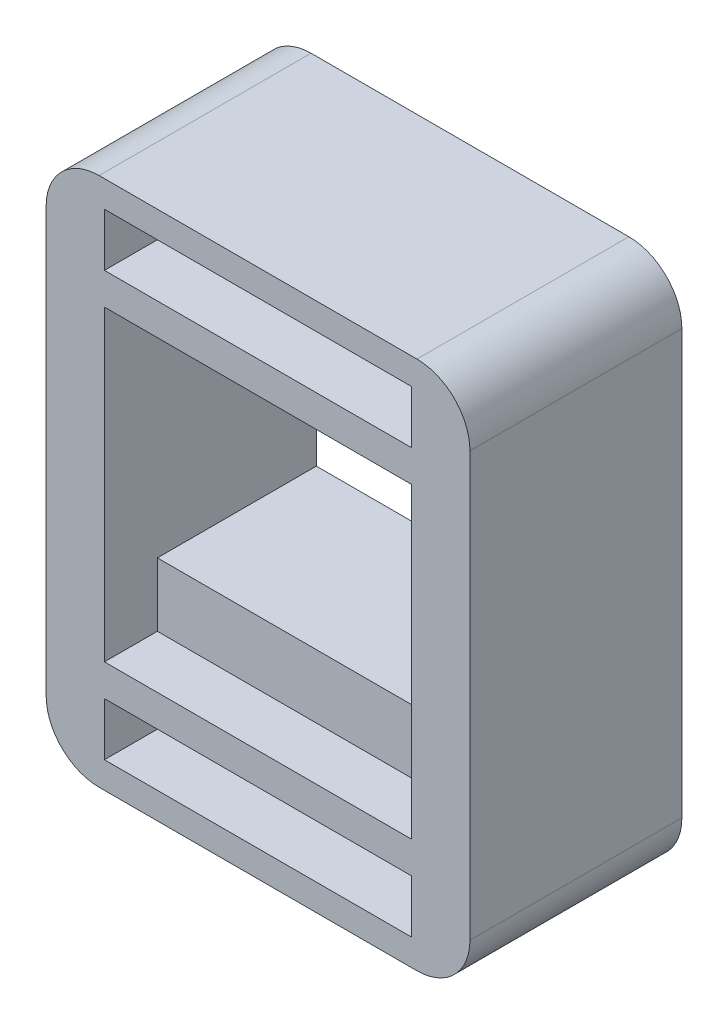
ISO-10303-21;
HEADER;
FILE_DESCRIPTION(('STEP AP214'),'2;1');
FILE_NAME('part.step','',(''),(''),'','','');
FILE_SCHEMA(('AUTOMOTIVE_DESIGN { 1 0 10303 214 1 1 1 1 }'));
ENDSEC;
DATA;
#1=APPLICATION_CONTEXT('core data for automotive mechanical design processes');
#2=APPLICATION_PROTOCOL_DEFINITION('international standard','automotive_design',2000,#1);
#3=PRODUCT_CONTEXT('',#1,'mechanical');
#4=PRODUCT('Part','Part','',(#3));
#5=PRODUCT_RELATED_PRODUCT_CATEGORY('part','',(#4));
#6=PRODUCT_DEFINITION_FORMATION('','',#4);
#7=PRODUCT_DEFINITION_CONTEXT('part definition',#1,'design');
#8=PRODUCT_DEFINITION('design','',#6,#7);
#9=PRODUCT_DEFINITION_SHAPE('','',#8);
#10=(LENGTH_UNIT() NAMED_UNIT(*) SI_UNIT(.MILLI.,.METRE.));
#11=(NAMED_UNIT(*) PLANE_ANGLE_UNIT() SI_UNIT($,.RADIAN.));
#12=(NAMED_UNIT(*) SI_UNIT($,.STERADIAN.) SOLID_ANGLE_UNIT());
#13=UNCERTAINTY_MEASURE_WITH_UNIT(LENGTH_MEASURE(1.E-05),#10,'distance_accuracy_value','');
#14=(GEOMETRIC_REPRESENTATION_CONTEXT(3) GLOBAL_UNCERTAINTY_ASSIGNED_CONTEXT((#13)) GLOBAL_UNIT_ASSIGNED_CONTEXT((#10,
#11,#12)) REPRESENTATION_CONTEXT('',''));
#15=CARTESIAN_POINT('',(0.,0.,0.));
#16=DIRECTION('',(0.,0.,1.));
#17=DIRECTION('',(1.,0.,0.));
#18=AXIS2_PLACEMENT_3D('',#15,#16,#17);
#19=CARTESIAN_POINT('',(0.,24.,20.));
#20=DIRECTION('',(0.,1.,0.));
#21=DIRECTION('',(0.,0.,1.));
#22=AXIS2_PLACEMENT_3D('',#19,#20,#21);
#23=PLANE('',#22);
#24=DIRECTION('',(1.,0.,0.));
#25=VECTOR('',#24,1.);
#26=CARTESIAN_POINT('',(8.,24.,15.));
#27=LINE('',#26,#25);
#28=CARTESIAN_POINT('',(0.,24.,15.));
#29=VERTEX_POINT('',#28);
#30=CARTESIAN_POINT('',(8.,24.,15.));
#31=VERTEX_POINT('',#30);
#32=EDGE_CURVE('E321',#29,#31,#27,.T.);
#33=ORIENTED_EDGE('',*,*,#32,.F.);
#34=DIRECTION('',(0.,0.,-1.));
#35=VECTOR('',#34,1.);
#36=CARTESIAN_POINT('',(0.,24.,20.));
#37=LINE('',#36,#35);
#38=CARTESIAN_POINT('',(0.,24.,0.));
#39=VERTEX_POINT('',#38);
#40=EDGE_CURVE('E469',#29,#39,#37,.T.);
#41=ORIENTED_EDGE('',*,*,#40,.T.);
#42=DIRECTION('',(1.,0.,0.));
#43=VECTOR('',#42,1.);
#44=CARTESIAN_POINT('',(0.,24.,0.));
#45=LINE('',#44,#43);
#46=CARTESIAN_POINT('',(8.,24.,0.));
#47=VERTEX_POINT('',#46);
#48=EDGE_CURVE('E374',#39,#47,#45,.T.);
#49=ORIENTED_EDGE('',*,*,#48,.T.);
#50=DIRECTION('',(0.,0.,-1.));
#51=VECTOR('',#50,1.);
#52=CARTESIAN_POINT('',(8.,24.,20.));
#53=LINE('',#52,#51);
#54=EDGE_CURVE('E482',#31,#47,#53,.T.);
#55=ORIENTED_EDGE('',*,*,#54,.F.);
#56=EDGE_LOOP('',(#33,#41,#49,#55));
#57=FACE_BOUND('',#56,.T.);
#58=ADVANCED_FACE('F77',(#57),#23,.F.);
#59=CARTESIAN_POINT('',(8.,0.,20.));
#60=DIRECTION('',(1.,0.,0.));
#61=DIRECTION('',(0.,0.,-1.));
#62=AXIS2_PLACEMENT_3D('',#59,#60,#61);
#63=PLANE('',#62);
#64=DIRECTION('',(0.,0.,-1.));
#65=VECTOR('',#64,1.);
#66=CARTESIAN_POINT('',(8.,29.,20.));
#67=LINE('',#66,#65);
#68=CARTESIAN_POINT('',(8.,29.,15.));
#69=VERTEX_POINT('',#68);
#70=CARTESIAN_POINT('',(8.,29.,0.));
#71=VERTEX_POINT('',#70);
#72=EDGE_CURVE('E480',#69,#71,#67,.T.);
#73=ORIENTED_EDGE('',*,*,#72,.F.);
#74=DIRECTION('',(0.,1.,0.));
#75=VECTOR('',#74,1.);
#76=CARTESIAN_POINT('',(8.,24.,15.));
#77=LINE('',#76,#75);
#78=EDGE_CURVE('E302',#31,#69,#77,.T.);
#79=ORIENTED_EDGE('',*,*,#78,.F.);
#80=ORIENTED_EDGE('',*,*,#54,.T.);
#81=DIRECTION('',(0.,-1.,0.));
#82=VECTOR('',#81,1.);
#83=CARTESIAN_POINT('',(8.,0.,0.));
#84=LINE('',#83,#82);
#85=EDGE_CURVE('E377',#71,#47,#84,.T.);
#86=ORIENTED_EDGE('',*,*,#85,.F.);
#87=EDGE_LOOP('',(#73,#79,#80,#86));
#88=FACE_BOUND('',#87,.T.);
#89=ADVANCED_FACE('F508',(#88),#63,.T.);
#90=CARTESIAN_POINT('',(0.,0.,20.));
#91=DIRECTION('',(-1.,0.,0.));
#92=DIRECTION('',(0.,-1.,0.));
#93=AXIS2_PLACEMENT_3D('',#90,#91,#92);
#94=PLANE('',#93);
#95=DIRECTION('',(0.,1.,0.));
#96=VECTOR('',#95,1.);
#97=CARTESIAN_POINT('',(0.,0.,0.));
#98=LINE('',#97,#96);
#99=CARTESIAN_POINT('',(0.,-8.,0.));
#100=VERTEX_POINT('',#99);
#101=CARTESIAN_POINT('',(0.,-3.,0.));
#102=VERTEX_POINT('',#101);
#103=EDGE_CURVE('E430',#100,#102,#98,.T.);
#104=ORIENTED_EDGE('',*,*,#103,.T.);
#105=DIRECTION('',(0.,0.,-1.));
#106=VECTOR('',#105,1.);
#107=CARTESIAN_POINT('',(0.,-3.,20.));
#108=LINE('',#107,#106);
#109=CARTESIAN_POINT('',(0.,-3.,20.));
#110=VERTEX_POINT('',#109);
#111=EDGE_CURVE('E443',#110,#102,#108,.T.);
#112=ORIENTED_EDGE('',*,*,#111,.F.);
#113=DIRECTION('',(0.,1.,0.));
#114=VECTOR('',#113,1.);
#115=CARTESIAN_POINT('',(0.,0.,20.));
#116=LINE('',#115,#114);
#117=CARTESIAN_POINT('',(0.,-8.,20.));
#118=VERTEX_POINT('',#117);
#119=EDGE_CURVE('E363',#118,#110,#116,.T.);
#120=ORIENTED_EDGE('',*,*,#119,.F.);
#121=DIRECTION('',(0.,0.,-1.));
#122=VECTOR('',#121,1.);
#123=CARTESIAN_POINT('',(0.,-8.,20.));
#124=LINE('',#123,#122);
#125=EDGE_CURVE('E446',#118,#100,#124,.T.);
#126=ORIENTED_EDGE('',*,*,#125,.T.);
#127=EDGE_LOOP('',(#104,#112,#120,#126));
#128=FACE_BOUND('',#127,.T.);
#129=ADVANCED_FACE('F531',(#128),#94,.F.);
#130=CARTESIAN_POINT('',(0.,-3.,20.));
#131=DIRECTION('',(0.,1.,0.));
#132=DIRECTION('',(0.,0.,1.));
#133=AXIS2_PLACEMENT_3D('',#130,#131,#132);
#134=PLANE('',#133);
#135=DIRECTION('',(1.,0.,0.));
#136=VECTOR('',#135,1.);
#137=CARTESIAN_POINT('',(0.,-3.,0.));
#138=LINE('',#137,#136);
#139=CARTESIAN_POINT('',(29.,-3.,0.));
#140=VERTEX_POINT('',#139);
#141=EDGE_CURVE('E433',#102,#140,#138,.T.);
#142=ORIENTED_EDGE('',*,*,#141,.T.);
#143=DIRECTION('',(0.,0.,-1.));
#144=VECTOR('',#143,1.);
#145=CARTESIAN_POINT('',(29.,-3.,20.));
#146=LINE('',#145,#144);
#147=CARTESIAN_POINT('',(29.,-3.,20.));
#148=VERTEX_POINT('',#147);
#149=EDGE_CURVE('E440',#148,#140,#146,.T.);
#150=ORIENTED_EDGE('',*,*,#149,.F.);
#151=DIRECTION('',(1.,0.,0.));
#152=VECTOR('',#151,1.);
#153=CARTESIAN_POINT('',(0.,-3.,20.));
#154=LINE('',#153,#152);
#155=EDGE_CURVE('E366',#110,#148,#154,.T.);
#156=ORIENTED_EDGE('',*,*,#155,.F.);
#157=ORIENTED_EDGE('',*,*,#111,.T.);
#158=EDGE_LOOP('',(#142,#150,#156,#157));
#159=FACE_BOUND('',#158,.T.);
#160=ADVANCED_FACE('F590',(#159),#134,.F.);
#161=CARTESIAN_POINT('',(29.,0.,20.));
#162=DIRECTION('',(-1.,0.,0.));
#163=DIRECTION('',(0.,0.,1.));
#164=AXIS2_PLACEMENT_3D('',#161,#162,#163);
#165=PLANE('',#164);
#166=DIRECTION('',(0.,1.,0.));
#167=VECTOR('',#166,1.);
#168=CARTESIAN_POINT('',(29.,0.,0.));
#169=LINE('',#168,#167);
#170=CARTESIAN_POINT('',(29.,-8.,0.));
#171=VERTEX_POINT('',#170);
#172=EDGE_CURVE('E325',#171,#140,#169,.T.);
#173=ORIENTED_EDGE('',*,*,#172,.F.);
#174=DIRECTION('',(0.,0.,-1.));
#175=VECTOR('',#174,1.);
#176=CARTESIAN_POINT('',(29.,-8.,20.));
#177=LINE('',#176,#175);
#178=CARTESIAN_POINT('',(29.,-8.,20.));
#179=VERTEX_POINT('',#178);
#180=EDGE_CURVE('E438',#179,#171,#177,.T.);
#181=ORIENTED_EDGE('',*,*,#180,.F.);
#182=DIRECTION('',(0.,1.,0.));
#183=VECTOR('',#182,1.);
#184=CARTESIAN_POINT('',(29.,0.,20.));
#185=LINE('',#184,#183);
#186=EDGE_CURVE('E368',#179,#148,#185,.T.);
#187=ORIENTED_EDGE('',*,*,#186,.T.);
#188=ORIENTED_EDGE('',*,*,#149,.T.);
#189=EDGE_LOOP('',(#173,#181,#187,#188));
#190=FACE_BOUND('',#189,.T.);
#191=ADVANCED_FACE('F586',(#190),#165,.T.);
#192=CARTESIAN_POINT('',(0.,-8.,20.));
#193=DIRECTION('',(0.,1.,0.));
#194=DIRECTION('',(0.,0.,1.));
#195=AXIS2_PLACEMENT_3D('',#192,#193,#194);
#196=PLANE('',#195);
#197=DIRECTION('',(1.,0.,0.));
#198=VECTOR('',#197,1.);
#199=CARTESIAN_POINT('',(0.,-8.,0.));
#200=LINE('',#199,#198);
#201=EDGE_CURVE('E427',#100,#171,#200,.T.);
#202=ORIENTED_EDGE('',*,*,#201,.F.);
#203=ORIENTED_EDGE('',*,*,#125,.F.);
#204=DIRECTION('',(1.,0.,0.));
#205=VECTOR('',#204,1.);
#206=CARTESIAN_POINT('',(0.,-8.,20.));
#207=LINE('',#206,#205);
#208=EDGE_CURVE('E360',#118,#179,#207,.T.);
#209=ORIENTED_EDGE('',*,*,#208,.T.);
#210=ORIENTED_EDGE('',*,*,#180,.T.);
#211=EDGE_LOOP('',(#202,#203,#209,#210));
#212=FACE_BOUND('',#211,.T.);
#213=ADVANCED_FACE('F560',(#212),#196,.T.);
#214=CARTESIAN_POINT('',(-0.5,-5.5,20.));
#215=DIRECTION('',(0.,0.,-1.));
#216=DIRECTION('',(-1.,0.,0.));
#217=AXIS2_PLACEMENT_3D('',#214,#215,#216);
#218=CYLINDRICAL_SURFACE('',#217,5.);
#219=CARTESIAN_POINT('',(-0.5,-5.5,0.));
#220=DIRECTION('',(0.,0.,1.));
#221=DIRECTION('',(1.,0.,0.));
#222=AXIS2_PLACEMENT_3D('',#219,#220,#221);
#223=CIRCLE('',#222,5.);
#224=CARTESIAN_POINT('',(-0.5,-10.5,0.));
#225=VERTEX_POINT('',#224);
#226=CARTESIAN_POINT('',(-5.5,-5.5,0.));
#227=VERTEX_POINT('',#226);
#228=EDGE_CURVE('E406',#225,#227,#223,.F.);
#229=ORIENTED_EDGE('',*,*,#228,.F.);
#230=DIRECTION('',(0.,0.,-1.));
#231=VECTOR('',#230,1.);
#232=CARTESIAN_POINT('',(-0.5,-10.5,20.));
#233=LINE('',#232,#231);
#234=CARTESIAN_POINT('',(-0.5,-10.5,20.));
#235=VERTEX_POINT('',#234);
#236=EDGE_CURVE('E463',#235,#225,#233,.T.);
#237=ORIENTED_EDGE('',*,*,#236,.F.);
#238=CARTESIAN_POINT('',(-0.5,-5.5,20.));
#239=DIRECTION('',(0.,0.,1.));
#240=DIRECTION('',(1.,0.,0.));
#241=AXIS2_PLACEMENT_3D('',#238,#239,#240);
#242=CIRCLE('',#241,5.);
#243=CARTESIAN_POINT('',(-5.5,-5.5,20.));
#244=VERTEX_POINT('',#243);
#245=EDGE_CURVE('E340',#235,#244,#242,.F.);
#246=ORIENTED_EDGE('',*,*,#245,.T.);
#247=DIRECTION('',(0.,0.,-1.));
#248=VECTOR('',#247,1.);
#249=CARTESIAN_POINT('',(-5.5,-5.5,20.));
#250=LINE('',#249,#248);
#251=EDGE_CURVE('E441',#244,#227,#250,.T.);
#252=ORIENTED_EDGE('',*,*,#251,.T.);
#253=EDGE_LOOP('',(#229,#237,#246,#252));
#254=FACE_BOUND('',#253,.T.);
#255=ADVANCED_FACE('F556',(#254),#218,.T.);
#256=CARTESIAN_POINT('',(0.,-10.5,20.));
#257=DIRECTION('',(0.,1.,0.));
#258=DIRECTION('',(0.,0.,1.));
#259=AXIS2_PLACEMENT_3D('',#256,#257,#258);
#260=PLANE('',#259);
#261=DIRECTION('',(1.,0.,0.));
#262=VECTOR('',#261,1.);
#263=CARTESIAN_POINT('',(0.,-10.5,0.));
#264=LINE('',#263,#262);
#265=CARTESIAN_POINT('',(29.5,-10.5,0.));
#266=VERTEX_POINT('',#265);
#267=EDGE_CURVE('E409',#225,#266,#264,.T.);
#268=ORIENTED_EDGE('',*,*,#267,.T.);
#269=DIRECTION('',(0.,0.,-1.));
#270=VECTOR('',#269,1.);
#271=CARTESIAN_POINT('',(29.5,-10.5,20.));
#272=LINE('',#271,#270);
#273=CARTESIAN_POINT('',(29.5,-10.5,20.));
#274=VERTEX_POINT('',#273);
#275=EDGE_CURVE('E460',#274,#266,#272,.T.);
#276=ORIENTED_EDGE('',*,*,#275,.F.);
#277=DIRECTION('',(1.,0.,0.));
#278=VECTOR('',#277,1.);
#279=CARTESIAN_POINT('',(0.,-10.5,20.));
#280=LINE('',#279,#278);
#281=EDGE_CURVE('E343',#235,#274,#280,.T.);
#282=ORIENTED_EDGE('',*,*,#281,.F.);
#283=ORIENTED_EDGE('',*,*,#236,.T.);
#284=EDGE_LOOP('',(#268,#276,#282,#283));
#285=FACE_BOUND('',#284,.T.);
#286=ADVANCED_FACE('F559',(#285),#260,.F.);
#287=CARTESIAN_POINT('',(29.5,-5.5,20.));
#288=DIRECTION('',(0.,0.,-1.));
#289=DIRECTION('',(-1.,0.,0.));
#290=AXIS2_PLACEMENT_3D('',#287,#288,#289);
#291=CYLINDRICAL_SURFACE('',#290,5.);
#292=CARTESIAN_POINT('',(29.5,-5.5,0.));
#293=DIRECTION('',(0.,0.,1.));
#294=DIRECTION('',(1.,0.,0.));
#295=AXIS2_PLACEMENT_3D('',#292,#293,#294);
#296=CIRCLE('',#295,5.);
#297=CARTESIAN_POINT('',(34.5,-5.5,0.));
#298=VERTEX_POINT('',#297);
#299=EDGE_CURVE('E412',#266,#298,#296,.T.);
#300=ORIENTED_EDGE('',*,*,#299,.T.);
#301=DIRECTION('',(0.,0.,-1.));
#302=VECTOR('',#301,1.);
#303=CARTESIAN_POINT('',(34.5,-5.5,20.));
#304=LINE('',#303,#302);
#305=CARTESIAN_POINT('',(34.5,-5.5,20.));
#306=VERTEX_POINT('',#305);
#307=EDGE_CURVE('E457',#306,#298,#304,.T.);
#308=ORIENTED_EDGE('',*,*,#307,.F.);
#309=CARTESIAN_POINT('',(29.5,-5.5,20.));
#310=DIRECTION('',(0.,0.,1.));
#311=DIRECTION('',(1.,0.,0.));
#312=AXIS2_PLACEMENT_3D('',#309,#310,#311);
#313=CIRCLE('',#312,5.);
#314=EDGE_CURVE('E346',#274,#306,#313,.T.);
#315=ORIENTED_EDGE('',*,*,#314,.F.);
#316=ORIENTED_EDGE('',*,*,#275,.T.);
#317=EDGE_LOOP('',(#300,#308,#315,#316));
#318=FACE_BOUND('',#317,.T.);
#319=ADVANCED_FACE('F564',(#318),#291,.T.);
#320=CARTESIAN_POINT('',(34.5,0.,20.));
#321=DIRECTION('',(-1.,0.,0.));
#322=DIRECTION('',(0.,0.,1.));
#323=AXIS2_PLACEMENT_3D('',#320,#321,#322);
#324=PLANE('',#323);
#325=DIRECTION('',(0.,1.,0.));
#326=VECTOR('',#325,1.);
#327=CARTESIAN_POINT('',(34.5,0.,0.));
#328=LINE('',#327,#326);
#329=CARTESIAN_POINT('',(34.5,34.5,0.));
#330=VERTEX_POINT('',#329);
#331=EDGE_CURVE('E415',#298,#330,#328,.T.);
#332=ORIENTED_EDGE('',*,*,#331,.T.);
#333=DIRECTION('',(0.,0.,-1.));
#334=VECTOR('',#333,1.);
#335=CARTESIAN_POINT('',(34.5,34.5,20.));
#336=LINE('',#335,#334);
#337=CARTESIAN_POINT('',(34.5,34.5,20.));
#338=VERTEX_POINT('',#337);
#339=EDGE_CURVE('E455',#338,#330,#336,.T.);
#340=ORIENTED_EDGE('',*,*,#339,.F.);
#341=DIRECTION('',(0.,1.,0.));
#342=VECTOR('',#341,1.);
#343=CARTESIAN_POINT('',(34.5,0.,20.));
#344=LINE('',#343,#342);
#345=EDGE_CURVE('E349',#306,#338,#344,.T.);
#346=ORIENTED_EDGE('',*,*,#345,.F.);
#347=ORIENTED_EDGE('',*,*,#307,.T.);
#348=EDGE_LOOP('',(#332,#340,#346,#347));
#349=FACE_BOUND('',#348,.T.);
#350=ADVANCED_FACE('F568',(#349),#324,.F.);
#351=CARTESIAN_POINT('',(29.5,34.5,20.));
#352=DIRECTION('',(0.,0.,-1.));
#353=DIRECTION('',(-1.,0.,0.));
#354=AXIS2_PLACEMENT_3D('',#351,#352,#353);
#355=CYLINDRICAL_SURFACE('',#354,5.);
#356=CARTESIAN_POINT('',(29.5,34.5,0.));
#357=DIRECTION('',(0.,0.,1.));
#358=DIRECTION('',(1.,0.,0.));
#359=AXIS2_PLACEMENT_3D('',#356,#357,#358);
#360=CIRCLE('',#359,5.);
#361=CARTESIAN_POINT('',(29.5,39.5,0.));
#362=VERTEX_POINT('',#361);
#363=EDGE_CURVE('E418',#362,#330,#360,.F.);
#364=ORIENTED_EDGE('',*,*,#363,.F.);
#365=DIRECTION('',(0.,0.,-1.));
#366=VECTOR('',#365,1.);
#367=CARTESIAN_POINT('',(29.5,39.5,20.));
#368=LINE('',#367,#366);
#369=CARTESIAN_POINT('',(29.5,39.5,20.));
#370=VERTEX_POINT('',#369);
#371=EDGE_CURVE('E453',#370,#362,#368,.T.);
#372=ORIENTED_EDGE('',*,*,#371,.F.);
#373=CARTESIAN_POINT('',(29.5,34.5,20.));
#374=DIRECTION('',(0.,0.,1.));
#375=DIRECTION('',(1.,0.,0.));
#376=AXIS2_PLACEMENT_3D('',#373,#374,#375);
#377=CIRCLE('',#376,5.);
#378=EDGE_CURVE('E351',#370,#338,#377,.F.);
#379=ORIENTED_EDGE('',*,*,#378,.T.);
#380=ORIENTED_EDGE('',*,*,#339,.T.);
#381=EDGE_LOOP('',(#364,#372,#379,#380));
#382=FACE_BOUND('',#381,.T.);
#383=ADVANCED_FACE('F572',(#382),#355,.T.);
#384=CARTESIAN_POINT('',(0.,39.5,20.));
#385=DIRECTION('',(0.,1.,0.));
#386=DIRECTION('',(0.,0.,1.));
#387=AXIS2_PLACEMENT_3D('',#384,#385,#386);
#388=PLANE('',#387);
#389=DIRECTION('',(1.,0.,0.));
#390=VECTOR('',#389,1.);
#391=CARTESIAN_POINT('',(0.,39.5,0.));
#392=LINE('',#391,#390);
#393=CARTESIAN_POINT('',(-0.5,39.5,0.));
#394=VERTEX_POINT('',#393);
#395=EDGE_CURVE('E421',#394,#362,#392,.T.);
#396=ORIENTED_EDGE('',*,*,#395,.F.);
#397=DIRECTION('',(0.,0.,-1.));
#398=VECTOR('',#397,1.);
#399=CARTESIAN_POINT('',(-0.5,39.5,20.));
#400=LINE('',#399,#398);
#401=CARTESIAN_POINT('',(-0.5,39.5,20.));
#402=VERTEX_POINT('',#401);
#403=EDGE_CURVE('E450',#402,#394,#400,.T.);
#404=ORIENTED_EDGE('',*,*,#403,.F.);
#405=DIRECTION('',(1.,0.,0.));
#406=VECTOR('',#405,1.);
#407=CARTESIAN_POINT('',(0.,39.5,20.));
#408=LINE('',#407,#406);
#409=EDGE_CURVE('E354',#402,#370,#408,.T.);
#410=ORIENTED_EDGE('',*,*,#409,.T.);
#411=ORIENTED_EDGE('',*,*,#371,.T.);
#412=EDGE_LOOP('',(#396,#404,#410,#411));
#413=FACE_BOUND('',#412,.T.);
#414=ADVANCED_FACE('F576',(#413),#388,.T.);
#415=CARTESIAN_POINT('',(-0.5,34.5,20.));
#416=DIRECTION('',(0.,0.,-1.));
#417=DIRECTION('',(-1.,0.,0.));
#418=AXIS2_PLACEMENT_3D('',#415,#416,#417);
#419=CYLINDRICAL_SURFACE('',#418,5.);
#420=CARTESIAN_POINT('',(-0.5,34.5,0.));
#421=DIRECTION('',(0.,0.,1.));
#422=DIRECTION('',(1.,0.,0.));
#423=AXIS2_PLACEMENT_3D('',#420,#421,#422);
#424=CIRCLE('',#423,5.);
#425=CARTESIAN_POINT('',(-5.5,34.5,0.));
#426=VERTEX_POINT('',#425);
#427=EDGE_CURVE('E424',#426,#394,#424,.F.);
#428=ORIENTED_EDGE('',*,*,#427,.F.);
#429=DIRECTION('',(0.,0.,-1.));
#430=VECTOR('',#429,1.);
#431=CARTESIAN_POINT('',(-5.5,34.5,20.));
#432=LINE('',#431,#430);
#433=CARTESIAN_POINT('',(-5.5,34.5,20.));
#434=VERTEX_POINT('',#433);
#435=EDGE_CURVE('E448',#434,#426,#432,.T.);
#436=ORIENTED_EDGE('',*,*,#435,.F.);
#437=CARTESIAN_POINT('',(-0.5,34.5,20.));
#438=DIRECTION('',(0.,0.,1.));
#439=DIRECTION('',(1.,0.,0.));
#440=AXIS2_PLACEMENT_3D('',#437,#438,#439);
#441=CIRCLE('',#440,5.);
#442=EDGE_CURVE('E357',#434,#402,#441,.F.);
#443=ORIENTED_EDGE('',*,*,#442,.T.);
#444=ORIENTED_EDGE('',*,*,#403,.T.);
#445=EDGE_LOOP('',(#428,#436,#443,#444));
#446=FACE_BOUND('',#445,.T.);
#447=ADVANCED_FACE('F554',(#446),#419,.T.);
#448=CARTESIAN_POINT('',(-5.5,0.,20.));
#449=DIRECTION('',(-1.,0.,0.));
#450=DIRECTION('',(0.,0.,1.));
#451=AXIS2_PLACEMENT_3D('',#448,#449,#450);
#452=PLANE('',#451);
#453=DIRECTION('',(0.,1.,0.));
#454=VECTOR('',#453,1.);
#455=CARTESIAN_POINT('',(-5.5,0.,0.));
#456=LINE('',#455,#454);
#457=EDGE_CURVE('E403',#227,#426,#456,.T.);
#458=ORIENTED_EDGE('',*,*,#457,.F.);
#459=ORIENTED_EDGE('',*,*,#251,.F.);
#460=DIRECTION('',(0.,1.,0.));
#461=VECTOR('',#460,1.);
#462=CARTESIAN_POINT('',(-5.5,0.,20.));
#463=LINE('',#462,#461);
#464=EDGE_CURVE('E337',#244,#434,#463,.T.);
#465=ORIENTED_EDGE('',*,*,#464,.T.);
#466=ORIENTED_EDGE('',*,*,#435,.T.);
#467=EDGE_LOOP('',(#458,#459,#465,#466));
#468=FACE_BOUND('',#467,.T.);
#469=ADVANCED_FACE('F544',(#468),#452,.T.);
#470=CARTESIAN_POINT('',(29.,0.,20.));
#471=DIRECTION('',(1.,0.,0.));
#472=DIRECTION('',(0.,0.,-1.));
#473=AXIS2_PLACEMENT_3D('',#470,#471,#472);
#474=PLANE('',#473);
#475=DIRECTION('',(0.,-1.,0.));
#476=VECTOR('',#475,1.);
#477=CARTESIAN_POINT('',(29.,0.,0.));
#478=LINE('',#477,#476);
#479=CARTESIAN_POINT('',(29.,37.,0.));
#480=VERTEX_POINT('',#479);
#481=CARTESIAN_POINT('',(29.,32.,0.));
#482=VERTEX_POINT('',#481);
#483=EDGE_CURVE('E394',#480,#482,#478,.T.);
#484=ORIENTED_EDGE('',*,*,#483,.T.);
#485=DIRECTION('',(0.,0.,-1.));
#486=VECTOR('',#485,1.);
#487=CARTESIAN_POINT('',(29.,32.,20.));
#488=LINE('',#487,#486);
#489=CARTESIAN_POINT('',(29.,32.,20.));
#490=VERTEX_POINT('',#489);
#491=EDGE_CURVE('E471',#490,#482,#488,.T.);
#492=ORIENTED_EDGE('',*,*,#491,.F.);
#493=DIRECTION('',(0.,-1.,0.));
#494=VECTOR('',#493,1.);
#495=CARTESIAN_POINT('',(29.,0.,20.));
#496=LINE('',#495,#494);
#497=CARTESIAN_POINT('',(29.,37.,20.));
#498=VERTEX_POINT('',#497);
#499=EDGE_CURVE('E329',#498,#490,#496,.T.);
#500=ORIENTED_EDGE('',*,*,#499,.F.);
#501=DIRECTION('',(0.,0.,-1.));
#502=VECTOR('',#501,1.);
#503=CARTESIAN_POINT('',(29.,37.,20.));
#504=LINE('',#503,#502);
#505=EDGE_CURVE('E451',#498,#480,#504,.T.);
#506=ORIENTED_EDGE('',*,*,#505,.T.);
#507=EDGE_LOOP('',(#484,#492,#500,#506));
#508=FACE_BOUND('',#507,.T.);
#509=ADVANCED_FACE('F540',(#508),#474,.F.);
#510=CARTESIAN_POINT('',(0.,32.,20.));
#511=DIRECTION('',(0.,1.,0.));
#512=DIRECTION('',(0.,0.,1.));
#513=AXIS2_PLACEMENT_3D('',#510,#511,#512);
#514=PLANE('',#513);
#515=DIRECTION('',(1.,0.,0.));
#516=VECTOR('',#515,1.);
#517=CARTESIAN_POINT('',(0.,32.,0.));
#518=LINE('',#517,#516);
#519=CARTESIAN_POINT('',(0.,32.,0.));
#520=VERTEX_POINT('',#519);
#521=EDGE_CURVE('E397',#520,#482,#518,.T.);
#522=ORIENTED_EDGE('',*,*,#521,.F.);
#523=DIRECTION('',(0.,0.,-1.));
#524=VECTOR('',#523,1.);
#525=CARTESIAN_POINT('',(0.,32.,20.));
#526=LINE('',#525,#524);
#527=CARTESIAN_POINT('',(0.,32.,20.));
#528=VERTEX_POINT('',#527);
#529=EDGE_CURVE('E468',#528,#520,#526,.T.);
#530=ORIENTED_EDGE('',*,*,#529,.F.);
#531=DIRECTION('',(1.,0.,0.));
#532=VECTOR('',#531,1.);
#533=CARTESIAN_POINT('',(0.,32.,20.));
#534=LINE('',#533,#532);
#535=EDGE_CURVE('E331',#528,#490,#534,.T.);
#536=ORIENTED_EDGE('',*,*,#535,.T.);
#537=ORIENTED_EDGE('',*,*,#491,.T.);
#538=EDGE_LOOP('',(#522,#530,#536,#537));
#539=FACE_BOUND('',#538,.T.);
#540=ADVANCED_FACE('F543',(#539),#514,.T.);
#541=CARTESIAN_POINT('',(0.,0.,20.));
#542=DIRECTION('',(1.,0.,0.));
#543=DIRECTION('',(0.,1.,0.));
#544=AXIS2_PLACEMENT_3D('',#541,#542,#543);
#545=PLANE('',#544);
#546=DIRECTION('',(0.,-1.,0.));
#547=VECTOR('',#546,1.);
#548=CARTESIAN_POINT('',(0.,0.,0.));
#549=LINE('',#548,#547);
#550=CARTESIAN_POINT('',(0.,37.,0.));
#551=VERTEX_POINT('',#550);
#552=EDGE_CURVE('E400',#551,#520,#549,.T.);
#553=ORIENTED_EDGE('',*,*,#552,.F.);
#554=DIRECTION('',(0.,0.,-1.));
#555=VECTOR('',#554,1.);
#556=CARTESIAN_POINT('',(0.,37.,20.));
#557=LINE('',#556,#555);
#558=CARTESIAN_POINT('',(0.,37.,20.));
#559=VERTEX_POINT('',#558);
#560=EDGE_CURVE('E466',#559,#551,#557,.T.);
#561=ORIENTED_EDGE('',*,*,#560,.F.);
#562=DIRECTION('',(0.,-1.,0.));
#563=VECTOR('',#562,1.);
#564=CARTESIAN_POINT('',(0.,0.,20.));
#565=LINE('',#564,#563);
#566=EDGE_CURVE('E334',#559,#528,#565,.T.);
#567=ORIENTED_EDGE('',*,*,#566,.T.);
#568=ORIENTED_EDGE('',*,*,#529,.T.);
#569=EDGE_LOOP('',(#553,#561,#567,#568));
#570=FACE_BOUND('',#569,.T.);
#571=ADVANCED_FACE('F523',(#570),#545,.T.);
#572=CARTESIAN_POINT('',(0.,37.,20.));
#573=DIRECTION('',(0.,1.,0.));
#574=DIRECTION('',(0.,0.,1.));
#575=AXIS2_PLACEMENT_3D('',#572,#573,#574);
#576=PLANE('',#575);
#577=DIRECTION('',(1.,0.,0.));
#578=VECTOR('',#577,1.);
#579=CARTESIAN_POINT('',(0.,37.,0.));
#580=LINE('',#579,#578);
#581=EDGE_CURVE('E391',#551,#480,#580,.T.);
#582=ORIENTED_EDGE('',*,*,#581,.T.);
#583=ORIENTED_EDGE('',*,*,#505,.F.);
#584=DIRECTION('',(1.,0.,0.));
#585=VECTOR('',#584,1.);
#586=CARTESIAN_POINT('',(0.,37.,20.));
#587=LINE('',#586,#585);
#588=EDGE_CURVE('E282',#559,#498,#587,.T.);
#589=ORIENTED_EDGE('',*,*,#588,.F.);
#590=ORIENTED_EDGE('',*,*,#560,.T.);
#591=EDGE_LOOP('',(#582,#583,#589,#590));
#592=FACE_BOUND('',#591,.T.);
#593=ADVANCED_FACE('F516',(#592),#576,.F.);
#594=CARTESIAN_POINT('',(0.,0.,20.));
#595=DIRECTION('',(-1.,0.,0.));
#596=DIRECTION('',(0.,0.,1.));
#597=AXIS2_PLACEMENT_3D('',#594,#595,#596);
#598=PLANE('',#597);
#599=DIRECTION('',(0.,1.,0.));
#600=VECTOR('',#599,1.);
#601=CARTESIAN_POINT('',(0.,0.,20.));
#602=LINE('',#601,#600);
#603=CARTESIAN_POINT('',(0.,0.,20.));
#604=VERTEX_POINT('',#603);
#605=CARTESIAN_POINT('',(0.,29.,20.));
#606=VERTEX_POINT('',#605);
#607=EDGE_CURVE('E270',#604,#606,#602,.T.);
#608=ORIENTED_EDGE('',*,*,#607,.F.);
#609=DIRECTION('',(0.,0.,1.));
#610=VECTOR('',#609,1.);
#611=CARTESIAN_POINT('',(0.,0.,15.));
#612=LINE('',#611,#610);
#613=CARTESIAN_POINT('',(0.,0.,15.));
#614=VERTEX_POINT('',#613);
#615=EDGE_CURVE('E303',#614,#604,#612,.T.);
#616=ORIENTED_EDGE('',*,*,#615,.F.);
#617=DIRECTION('',(0.,-1.,0.));
#618=VECTOR('',#617,1.);
#619=CARTESIAN_POINT('',(0.,0.,15.));
#620=LINE('',#619,#618);
#621=CARTESIAN_POINT('',(0.,6.,15.));
#622=VERTEX_POINT('',#621);
#623=EDGE_CURVE('E293',#622,#614,#620,.T.);
#624=ORIENTED_EDGE('',*,*,#623,.F.);
#625=DIRECTION('',(0.,0.,-1.));
#626=VECTOR('',#625,1.);
#627=CARTESIAN_POINT('',(0.,6.,20.));
#628=LINE('',#627,#626);
#629=CARTESIAN_POINT('',(0.,6.,0.));
#630=VERTEX_POINT('',#629);
#631=EDGE_CURVE('E12',#622,#630,#628,.T.);
#632=ORIENTED_EDGE('',*,*,#631,.T.);
#633=DIRECTION('',(0.,1.,0.));
#634=VECTOR('',#633,1.);
#635=CARTESIAN_POINT('',(0.,0.,0.));
#636=LINE('',#635,#634);
#637=EDGE_CURVE('E372',#630,#39,#636,.T.);
#638=ORIENTED_EDGE('',*,*,#637,.T.);
#639=ORIENTED_EDGE('',*,*,#40,.F.);
#640=DIRECTION('',(0.,-1.,0.));
#641=VECTOR('',#640,1.);
#642=CARTESIAN_POINT('',(0.,24.,15.));
#643=LINE('',#642,#641);
#644=CARTESIAN_POINT('',(0.,29.,15.));
#645=VERTEX_POINT('',#644);
#646=EDGE_CURVE('E319',#645,#29,#643,.T.);
#647=ORIENTED_EDGE('',*,*,#646,.F.);
#648=DIRECTION('',(0.,0.,1.));
#649=VECTOR('',#648,1.);
#650=CARTESIAN_POINT('',(0.,29.,15.));
#651=LINE('',#650,#649);
#652=EDGE_CURVE('E323',#645,#606,#651,.T.);
#653=ORIENTED_EDGE('',*,*,#652,.T.);
#654=EDGE_LOOP('',(#608,#616,#624,#632,#638,#639,#647,#653));
#655=FACE_BOUND('',#654,.T.);
#656=ADVANCED_FACE('F514',(#655),#598,.F.);
#657=CARTESIAN_POINT('',(0.,29.,20.));
#658=DIRECTION('',(0.,1.,0.));
#659=DIRECTION('',(0.,0.,1.));
#660=AXIS2_PLACEMENT_3D('',#657,#658,#659);
#661=PLANE('',#660);
#662=DIRECTION('',(1.,0.,0.));
#663=VECTOR('',#662,1.);
#664=CARTESIAN_POINT('',(0.,29.,0.));
#665=LINE('',#664,#663);
#666=CARTESIAN_POINT('',(21.,29.,0.));
#667=VERTEX_POINT('',#666);
#668=EDGE_CURVE('E380',#71,#667,#665,.T.);
#669=ORIENTED_EDGE('',*,*,#668,.T.);
#670=DIRECTION('',(0.,0.,-1.));
#671=VECTOR('',#670,1.);
#672=CARTESIAN_POINT('',(21.,29.,20.));
#673=LINE('',#672,#671);
#674=CARTESIAN_POINT('',(21.,29.,15.));
#675=VERTEX_POINT('',#674);
#676=EDGE_CURVE('E478',#675,#667,#673,.T.);
#677=ORIENTED_EDGE('',*,*,#676,.F.);
#678=DIRECTION('',(-1.,0.,0.));
#679=VECTOR('',#678,1.);
#680=CARTESIAN_POINT('',(21.,29.,15.));
#681=LINE('',#680,#679);
#682=CARTESIAN_POINT('',(29.,29.,15.));
#683=VERTEX_POINT('',#682);
#684=EDGE_CURVE('E288',#683,#675,#681,.T.);
#685=ORIENTED_EDGE('',*,*,#684,.F.);
#686=DIRECTION('',(0.,0.,1.));
#687=VECTOR('',#686,1.);
#688=CARTESIAN_POINT('',(29.,29.,15.));
#689=LINE('',#688,#687);
#690=CARTESIAN_POINT('',(29.,29.,20.));
#691=VERTEX_POINT('',#690);
#692=EDGE_CURVE('E278',#683,#691,#689,.T.);
#693=ORIENTED_EDGE('',*,*,#692,.T.);
#694=DIRECTION('',(1.,0.,0.));
#695=VECTOR('',#694,1.);
#696=CARTESIAN_POINT('',(0.,29.,20.));
#697=LINE('',#696,#695);
#698=EDGE_CURVE('E263',#606,#691,#697,.T.);
#699=ORIENTED_EDGE('',*,*,#698,.F.);
#700=ORIENTED_EDGE('',*,*,#652,.F.);
#701=DIRECTION('',(-1.,0.,0.));
#702=VECTOR('',#701,1.);
#703=CARTESIAN_POINT('',(8.,29.,15.));
#704=LINE('',#703,#702);
#705=EDGE_CURVE('E316',#69,#645,#704,.T.);
#706=ORIENTED_EDGE('',*,*,#705,.F.);
#707=ORIENTED_EDGE('',*,*,#72,.T.);
#708=EDGE_LOOP('',(#669,#677,#685,#693,#699,#700,#706,#707));
#709=FACE_BOUND('',#708,.T.);
#710=ADVANCED_FACE('F286',(#709),#661,.F.);
#711=CARTESIAN_POINT('',(21.,0.,20.));
#712=DIRECTION('',(1.,0.,0.));
#713=DIRECTION('',(0.,0.,-1.));
#714=AXIS2_PLACEMENT_3D('',#711,#712,#713);
#715=PLANE('',#714);
#716=DIRECTION('',(0.,0.,-1.));
#717=VECTOR('',#716,1.);
#718=CARTESIAN_POINT('',(21.,24.,20.));
#719=LINE('',#718,#717);
#720=CARTESIAN_POINT('',(21.,24.,15.));
#721=VERTEX_POINT('',#720);
#722=CARTESIAN_POINT('',(21.,24.,0.));
#723=VERTEX_POINT('',#722);
#724=EDGE_CURVE('E476',#721,#723,#719,.T.);
#725=ORIENTED_EDGE('',*,*,#724,.F.);
#726=DIRECTION('',(0.,-1.,0.));
#727=VECTOR('',#726,1.);
#728=CARTESIAN_POINT('',(21.,24.,15.));
#729=LINE('',#728,#727);
#730=EDGE_CURVE('E300',#675,#721,#729,.T.);
#731=ORIENTED_EDGE('',*,*,#730,.F.);
#732=ORIENTED_EDGE('',*,*,#676,.T.);
#733=DIRECTION('',(0.,-1.,0.));
#734=VECTOR('',#733,1.);
#735=CARTESIAN_POINT('',(21.,0.,0.));
#736=LINE('',#735,#734);
#737=EDGE_CURVE('E382',#667,#723,#736,.T.);
#738=ORIENTED_EDGE('',*,*,#737,.T.);
#739=EDGE_LOOP('',(#725,#731,#732,#738));
#740=FACE_BOUND('',#739,.T.);
#741=ADVANCED_FACE('F503',(#740),#715,.F.);
#742=CARTESIAN_POINT('',(0.,24.,20.));
#743=DIRECTION('',(0.,-1.,0.));
#744=DIRECTION('',(0.,0.,-1.));
#745=AXIS2_PLACEMENT_3D('',#742,#743,#744);
#746=PLANE('',#745);
#747=DIRECTION('',(1.,0.,0.));
#748=VECTOR('',#747,1.);
#749=CARTESIAN_POINT('',(21.,24.,15.));
#750=LINE('',#749,#748);
#751=CARTESIAN_POINT('',(29.,24.,15.));
#752=VERTEX_POINT('',#751);
#753=EDGE_CURVE('E297',#721,#752,#750,.T.);
#754=ORIENTED_EDGE('',*,*,#753,.F.);
#755=ORIENTED_EDGE('',*,*,#724,.T.);
#756=DIRECTION('',(-1.,0.,0.));
#757=VECTOR('',#756,1.);
#758=CARTESIAN_POINT('',(0.,24.,0.));
#759=LINE('',#758,#757);
#760=CARTESIAN_POINT('',(29.,24.,0.));
#761=VERTEX_POINT('',#760);
#762=EDGE_CURVE('E385',#761,#723,#759,.T.);
#763=ORIENTED_EDGE('',*,*,#762,.F.);
#764=DIRECTION('',(0.,0.,-1.));
#765=VECTOR('',#764,1.);
#766=CARTESIAN_POINT('',(29.,24.,20.));
#767=LINE('',#766,#765);
#768=EDGE_CURVE('E371',#752,#761,#767,.T.);
#769=ORIENTED_EDGE('',*,*,#768,.F.);
#770=EDGE_LOOP('',(#754,#755,#763,#769));
#771=FACE_BOUND('',#770,.T.);
#772=ADVANCED_FACE('F497',(#771),#746,.T.);
#773=CARTESIAN_POINT('',(29.,0.,20.));
#774=DIRECTION('',(-1.,0.,0.));
#775=DIRECTION('',(0.,0.,1.));
#776=AXIS2_PLACEMENT_3D('',#773,#774,#775);
#777=PLANE('',#776);
#778=DIRECTION('',(0.,0.,-1.));
#779=VECTOR('',#778,1.);
#780=CARTESIAN_POINT('',(29.,6.,20.));
#781=LINE('',#780,#779);
#782=CARTESIAN_POINT('',(29.,6.,15.));
#783=VERTEX_POINT('',#782);
#784=CARTESIAN_POINT('',(29.,6.,0.));
#785=VERTEX_POINT('',#784);
#786=EDGE_CURVE('E86',#783,#785,#781,.T.);
#787=ORIENTED_EDGE('',*,*,#786,.F.);
#788=DIRECTION('',(0.,1.,0.));
#789=VECTOR('',#788,1.);
#790=CARTESIAN_POINT('',(29.,0.,15.));
#791=LINE('',#790,#789);
#792=CARTESIAN_POINT('',(29.,0.,15.));
#793=VERTEX_POINT('',#792);
#794=EDGE_CURVE('E93',#793,#783,#791,.T.);
#795=ORIENTED_EDGE('',*,*,#794,.F.);
#796=DIRECTION('',(0.,0.,1.));
#797=VECTOR('',#796,1.);
#798=CARTESIAN_POINT('',(29.,0.,15.));
#799=LINE('',#798,#797);
#800=CARTESIAN_POINT('',(29.,0.,20.));
#801=VERTEX_POINT('',#800);
#802=EDGE_CURVE('E280',#793,#801,#799,.T.);
#803=ORIENTED_EDGE('',*,*,#802,.T.);
#804=DIRECTION('',(0.,1.,0.));
#805=VECTOR('',#804,1.);
#806=CARTESIAN_POINT('',(29.,0.,20.));
#807=LINE('',#806,#805);
#808=EDGE_CURVE('E268',#801,#691,#807,.T.);
#809=ORIENTED_EDGE('',*,*,#808,.T.);
#810=ORIENTED_EDGE('',*,*,#692,.F.);
#811=DIRECTION('',(0.,1.,0.));
#812=VECTOR('',#811,1.);
#813=CARTESIAN_POINT('',(29.,24.,15.));
#814=LINE('',#813,#812);
#815=EDGE_CURVE('E291',#752,#683,#814,.T.);
#816=ORIENTED_EDGE('',*,*,#815,.F.);
#817=ORIENTED_EDGE('',*,*,#768,.T.);
#818=DIRECTION('',(0.,1.,0.));
#819=VECTOR('',#818,1.);
#820=CARTESIAN_POINT('',(29.,0.,0.));
#821=LINE('',#820,#819);
#822=EDGE_CURVE('E388',#785,#761,#821,.T.);
#823=ORIENTED_EDGE('',*,*,#822,.F.);
#824=EDGE_LOOP('',(#787,#795,#803,#809,#810,#816,#817,#823));
#825=FACE_BOUND('',#824,.T.);
#826=ADVANCED_FACE('F277',(#825),#777,.T.);
#827=CARTESIAN_POINT('',(0.,0.,0.));
#828=DIRECTION('',(0.,0.,1.));
#829=DIRECTION('',(1.,0.,0.));
#830=AXIS2_PLACEMENT_3D('',#827,#828,#829);
#831=PLANE('',#830);
#832=ORIENTED_EDGE('',*,*,#637,.F.);
#833=DIRECTION('',(1.,0.,0.));
#834=VECTOR('',#833,1.);
#835=CARTESIAN_POINT('',(0.,6.,0.));
#836=LINE('',#835,#834);
#837=EDGE_CURVE('E81',#630,#785,#836,.T.);
#838=ORIENTED_EDGE('',*,*,#837,.T.);
#839=ORIENTED_EDGE('',*,*,#822,.T.);
#840=ORIENTED_EDGE('',*,*,#762,.T.);
#841=ORIENTED_EDGE('',*,*,#737,.F.);
#842=ORIENTED_EDGE('',*,*,#668,.F.);
#843=ORIENTED_EDGE('',*,*,#85,.T.);
#844=ORIENTED_EDGE('',*,*,#48,.F.);
#845=EDGE_LOOP('',(#832,#838,#839,#840,#841,#842,#843,#844));
#846=FACE_BOUND('',#845,.T.);
#847=ORIENTED_EDGE('',*,*,#581,.F.);
#848=ORIENTED_EDGE('',*,*,#552,.T.);
#849=ORIENTED_EDGE('',*,*,#521,.T.);
#850=ORIENTED_EDGE('',*,*,#483,.F.);
#851=EDGE_LOOP('',(#847,#848,#849,#850));
#852=FACE_BOUND('',#851,.T.);
#853=ORIENTED_EDGE('',*,*,#457,.T.);
#854=ORIENTED_EDGE('',*,*,#427,.T.);
#855=ORIENTED_EDGE('',*,*,#395,.T.);
#856=ORIENTED_EDGE('',*,*,#363,.T.);
#857=ORIENTED_EDGE('',*,*,#331,.F.);
#858=ORIENTED_EDGE('',*,*,#299,.F.);
#859=ORIENTED_EDGE('',*,*,#267,.F.);
#860=ORIENTED_EDGE('',*,*,#228,.T.);
#861=EDGE_LOOP('',(#853,#854,#855,#856,#857,#858,#859,#860));
#862=FACE_BOUND('',#861,.T.);
#863=ORIENTED_EDGE('',*,*,#201,.T.);
#864=ORIENTED_EDGE('',*,*,#172,.T.);
#865=ORIENTED_EDGE('',*,*,#141,.F.);
#866=ORIENTED_EDGE('',*,*,#103,.F.);
#867=EDGE_LOOP('',(#863,#864,#865,#866));
#868=FACE_BOUND('',#867,.T.);
#869=ADVANCED_FACE('F490',(#846,#852,#862,#868),#831,.F.);
#870=CARTESIAN_POINT('',(0.,0.,20.));
#871=DIRECTION('',(0.,0.,1.));
#872=DIRECTION('',(1.,0.,0.));
#873=AXIS2_PLACEMENT_3D('',#870,#871,#872);
#874=PLANE('',#873);
#875=DIRECTION('',(1.,0.,0.));
#876=VECTOR('',#875,1.);
#877=CARTESIAN_POINT('',(0.,0.,20.));
#878=LINE('',#877,#876);
#879=EDGE_CURVE('E289',#604,#801,#878,.T.);
#880=ORIENTED_EDGE('',*,*,#879,.F.);
#881=ORIENTED_EDGE('',*,*,#607,.T.);
#882=ORIENTED_EDGE('',*,*,#698,.T.);
#883=ORIENTED_EDGE('',*,*,#808,.F.);
#884=EDGE_LOOP('',(#880,#881,#882,#883));
#885=FACE_BOUND('',#884,.T.);
#886=ORIENTED_EDGE('',*,*,#588,.T.);
#887=ORIENTED_EDGE('',*,*,#499,.T.);
#888=ORIENTED_EDGE('',*,*,#535,.F.);
#889=ORIENTED_EDGE('',*,*,#566,.F.);
#890=EDGE_LOOP('',(#886,#887,#888,#889));
#891=FACE_BOUND('',#890,.T.);
#892=ORIENTED_EDGE('',*,*,#464,.F.);
#893=ORIENTED_EDGE('',*,*,#245,.F.);
#894=ORIENTED_EDGE('',*,*,#281,.T.);
#895=ORIENTED_EDGE('',*,*,#314,.T.);
#896=ORIENTED_EDGE('',*,*,#345,.T.);
#897=ORIENTED_EDGE('',*,*,#378,.F.);
#898=ORIENTED_EDGE('',*,*,#409,.F.);
#899=ORIENTED_EDGE('',*,*,#442,.F.);
#900=EDGE_LOOP('',(#892,#893,#894,#895,#896,#897,#898,#899));
#901=FACE_BOUND('',#900,.T.);
#902=ORIENTED_EDGE('',*,*,#208,.F.);
#903=ORIENTED_EDGE('',*,*,#119,.T.);
#904=ORIENTED_EDGE('',*,*,#155,.T.);
#905=ORIENTED_EDGE('',*,*,#186,.F.);
#906=EDGE_LOOP('',(#902,#903,#904,#905));
#907=FACE_BOUND('',#906,.T.);
#908=ADVANCED_FACE('F266',(#885,#891,#901,#907),#874,.T.);
#909=CARTESIAN_POINT('',(0.,6.,20.));
#910=DIRECTION('',(0.,1.,0.));
#911=DIRECTION('',(0.,0.,1.));
#912=AXIS2_PLACEMENT_3D('',#909,#910,#911);
#913=PLANE('',#912);
#914=DIRECTION('',(-1.,0.,0.));
#915=VECTOR('',#914,1.);
#916=CARTESIAN_POINT('',(0.,6.,15.));
#917=LINE('',#916,#915);
#918=EDGE_CURVE('E306',#783,#622,#917,.T.);
#919=ORIENTED_EDGE('',*,*,#918,.F.);
#920=ORIENTED_EDGE('',*,*,#786,.T.);
#921=ORIENTED_EDGE('',*,*,#837,.F.);
#922=ORIENTED_EDGE('',*,*,#631,.F.);
#923=EDGE_LOOP('',(#919,#920,#921,#922));
#924=FACE_BOUND('',#923,.T.);
#925=ADVANCED_FACE('F79',(#924),#913,.T.);
#926=CARTESIAN_POINT('',(0.,0.,15.));
#927=DIRECTION('',(0.,-1.,0.));
#928=DIRECTION('',(0.,0.,-1.));
#929=AXIS2_PLACEMENT_3D('',#926,#927,#928);
#930=PLANE('',#929);
#931=ORIENTED_EDGE('',*,*,#879,.T.);
#932=ORIENTED_EDGE('',*,*,#802,.F.);
#933=DIRECTION('',(1.,0.,0.));
#934=VECTOR('',#933,1.);
#935=CARTESIAN_POINT('',(0.,0.,15.));
#936=LINE('',#935,#934);
#937=EDGE_CURVE('E310',#614,#793,#936,.T.);
#938=ORIENTED_EDGE('',*,*,#937,.F.);
#939=ORIENTED_EDGE('',*,*,#615,.T.);
#940=EDGE_LOOP('',(#931,#932,#938,#939));
#941=FACE_BOUND('',#940,.T.);
#942=ADVANCED_FACE('F609',(#941),#930,.F.);
#943=CARTESIAN_POINT('',(0.,0.,15.));
#944=DIRECTION('',(0.,0.,-1.));
#945=DIRECTION('',(-1.,0.,0.));
#946=AXIS2_PLACEMENT_3D('',#943,#944,#945);
#947=PLANE('',#946);
#948=ORIENTED_EDGE('',*,*,#623,.T.);
#949=ORIENTED_EDGE('',*,*,#937,.T.);
#950=ORIENTED_EDGE('',*,*,#794,.T.);
#951=ORIENTED_EDGE('',*,*,#918,.T.);
#952=EDGE_LOOP('',(#948,#949,#950,#951));
#953=FACE_BOUND('',#952,.T.);
#954=ADVANCED_FACE('F605',(#953),#947,.F.);
#955=CARTESIAN_POINT('',(0.,0.,15.));
#956=DIRECTION('',(0.,0.,1.));
#957=DIRECTION('',(1.,0.,0.));
#958=AXIS2_PLACEMENT_3D('',#955,#956,#957);
#959=PLANE('',#958);
#960=ORIENTED_EDGE('',*,*,#78,.T.);
#961=ORIENTED_EDGE('',*,*,#705,.T.);
#962=ORIENTED_EDGE('',*,*,#646,.T.);
#963=ORIENTED_EDGE('',*,*,#32,.T.);
#964=EDGE_LOOP('',(#960,#961,#962,#963));
#965=FACE_BOUND('',#964,.T.);
#966=ADVANCED_FACE('F601',(#965),#959,.T.);
#967=CARTESIAN_POINT('',(0.,0.,15.));
#968=DIRECTION('',(0.,0.,-1.));
#969=DIRECTION('',(-1.,0.,0.));
#970=AXIS2_PLACEMENT_3D('',#967,#968,#969);
#971=PLANE('',#970);
#972=ORIENTED_EDGE('',*,*,#730,.T.);
#973=ORIENTED_EDGE('',*,*,#753,.T.);
#974=ORIENTED_EDGE('',*,*,#815,.T.);
#975=ORIENTED_EDGE('',*,*,#684,.T.);
#976=EDGE_LOOP('',(#972,#973,#974,#975));
#977=FACE_BOUND('',#976,.T.);
#978=ADVANCED_FACE('F604',(#977),#971,.F.);
#979=CLOSED_SHELL('',(#58,#89,#129,#160,#191,#213,#255,#286,#319,#350,#383,#414,#447,#469,#509,
#540,#571,#593,#656,#710,#741,#772,#826,#869,#908,#925,#942,#954,#966,#978));
#980=MANIFOLD_SOLID_BREP('B2',#979);
#981=ADVANCED_BREP_SHAPE_REPRESENTATION('',(#18,#980),#14);
#982=SHAPE_DEFINITION_REPRESENTATION(#9,#981);
ENDSEC;
END-ISO-10303-21;
